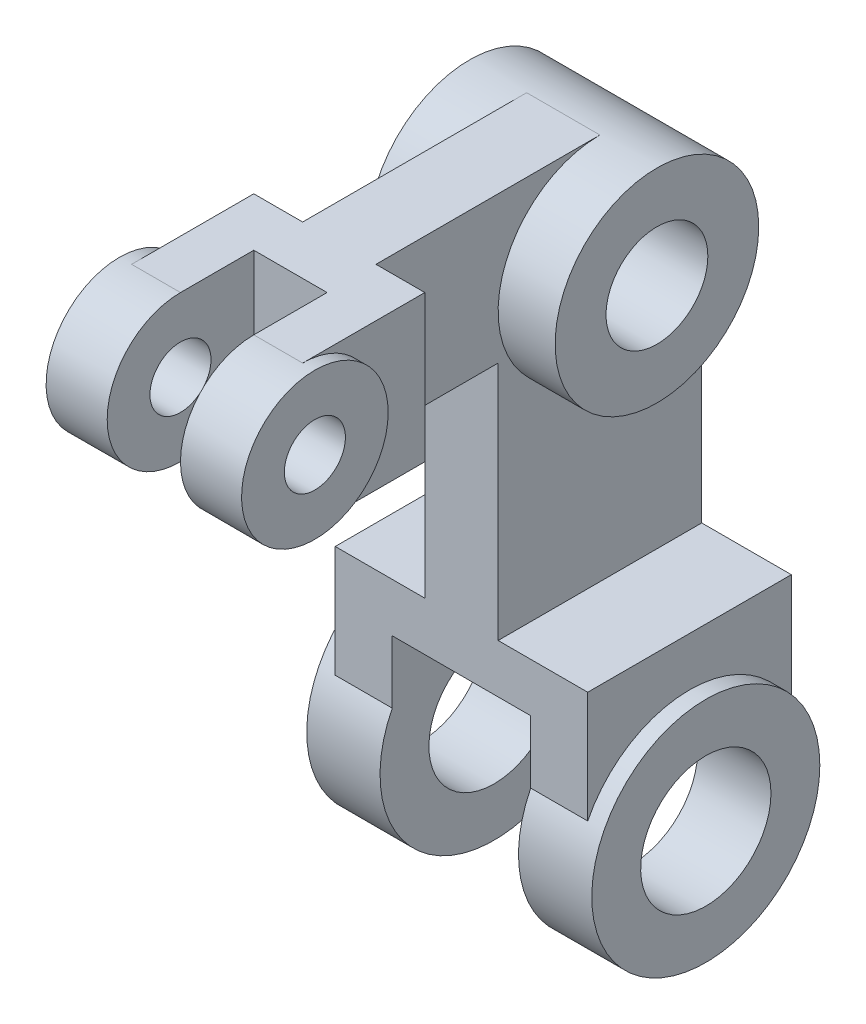
ISO-10303-21;
HEADER;
FILE_DESCRIPTION(('STEP AP214'),'2;1');
FILE_NAME('part.step','',(''),(''),'','','');
FILE_SCHEMA(('AUTOMOTIVE_DESIGN { 1 0 10303 214 1 1 1 1 }'));
ENDSEC;
DATA;
#1=APPLICATION_CONTEXT('core data for automotive mechanical design processes');
#2=APPLICATION_PROTOCOL_DEFINITION('international standard','automotive_design',2000,#1);
#3=PRODUCT_CONTEXT('',#1,'mechanical');
#4=PRODUCT('Part','Part','',(#3));
#5=PRODUCT_RELATED_PRODUCT_CATEGORY('part','',(#4));
#6=PRODUCT_DEFINITION_FORMATION('','',#4);
#7=PRODUCT_DEFINITION_CONTEXT('part definition',#1,'design');
#8=PRODUCT_DEFINITION('design','',#6,#7);
#9=PRODUCT_DEFINITION_SHAPE('','',#8);
#10=(LENGTH_UNIT() NAMED_UNIT(*) SI_UNIT(.MILLI.,.METRE.));
#11=(NAMED_UNIT(*) PLANE_ANGLE_UNIT() SI_UNIT($,.RADIAN.));
#12=(NAMED_UNIT(*) SI_UNIT($,.STERADIAN.) SOLID_ANGLE_UNIT());
#13=UNCERTAINTY_MEASURE_WITH_UNIT(LENGTH_MEASURE(1.E-05),#10,'distance_accuracy_value','');
#14=(GEOMETRIC_REPRESENTATION_CONTEXT(3) GLOBAL_UNCERTAINTY_ASSIGNED_CONTEXT((#13)) GLOBAL_UNIT_ASSIGNED_CONTEXT((#10,
#11,#12)) REPRESENTATION_CONTEXT('',''));
#15=CARTESIAN_POINT('',(0.,0.,0.));
#16=DIRECTION('',(0.,0.,1.));
#17=DIRECTION('',(1.,0.,0.));
#18=AXIS2_PLACEMENT_3D('',#15,#16,#17);
#19=CARTESIAN_POINT('',(24.,117.,85.));
#20=DIRECTION('',(-1.,0.,0.));
#21=DIRECTION('',(0.,0.,1.));
#22=AXIS2_PLACEMENT_3D('',#19,#20,#21);
#23=CYLINDRICAL_SURFACE('',#22,7.50000000000001);
#24=CARTESIAN_POINT('',(-8.99999999999999,117.,85.));
#25=DIRECTION('',(-1.,0.,0.));
#26=DIRECTION('',(0.,0.,1.));
#27=AXIS2_PLACEMENT_3D('',#24,#25,#26);
#28=CIRCLE('',#27,7.50000000000001);
#29=CARTESIAN_POINT('',(-8.99999999999999,117.,92.5));
#30=VERTEX_POINT('',#29);
#31=EDGE_CURVE('E226',#30,#30,#28,.T.);
#32=ORIENTED_EDGE('',*,*,#31,.F.);
#33=EDGE_LOOP('',(#32));
#34=FACE_BOUND('',#33,.T.);
#35=CARTESIAN_POINT('',(-24.,117.,85.));
#36=DIRECTION('',(1.,0.,0.));
#37=DIRECTION('',(0.,0.,-1.));
#38=AXIS2_PLACEMENT_3D('',#35,#36,#37);
#39=CIRCLE('',#38,7.50000000000001);
#40=CARTESIAN_POINT('',(-24.,117.,77.5));
#41=VERTEX_POINT('',#40);
#42=EDGE_CURVE('E253',#41,#41,#39,.T.);
#43=ORIENTED_EDGE('',*,*,#42,.F.);
#44=EDGE_LOOP('',(#43));
#45=FACE_BOUND('',#44,.T.);
#46=ADVANCED_FACE('F39',(#34,#45),#23,.F.);
#47=CARTESIAN_POINT('',(24.,117.,85.));
#48=DIRECTION('',(-1.,0.,0.));
#49=DIRECTION('',(0.,0.,1.));
#50=AXIS2_PLACEMENT_3D('',#47,#48,#49);
#51=CYLINDRICAL_SURFACE('',#50,18.);
#52=CARTESIAN_POINT('',(-24.,117.,85.));
#53=DIRECTION('',(1.,0.,0.));
#54=DIRECTION('',(0.,0.,-1.));
#55=AXIS2_PLACEMENT_3D('',#52,#53,#54);
#56=CIRCLE('',#55,18.);
#57=CARTESIAN_POINT('',(-24.,117.,67.));
#58=VERTEX_POINT('',#57);
#59=EDGE_CURVE('E258',#58,#58,#56,.T.);
#60=ORIENTED_EDGE('',*,*,#59,.T.);
#61=EDGE_LOOP('',(#60));
#62=FACE_BOUND('',#61,.T.);
#63=CARTESIAN_POINT('',(-8.99999999999999,117.,85.));
#64=DIRECTION('',(-1.,0.,0.));
#65=DIRECTION('',(0.,0.,1.));
#66=AXIS2_PLACEMENT_3D('',#63,#64,#65);
#67=CIRCLE('',#66,18.);
#68=CARTESIAN_POINT('',(-8.99999999999999,99.,85.));
#69=VERTEX_POINT('',#68);
#70=CARTESIAN_POINT('',(-8.99999999999999,135.,85.));
#71=VERTEX_POINT('',#70);
#72=EDGE_CURVE('E47',#69,#71,#67,.T.);
#73=ORIENTED_EDGE('',*,*,#72,.T.);
#74=DIRECTION('',(-1.,0.,0.));
#75=VECTOR('',#74,1.);
#76=CARTESIAN_POINT('',(21.,135.,85.));
#77=LINE('',#76,#75);
#78=CARTESIAN_POINT('',(-21.,135.,85.));
#79=VERTEX_POINT('',#78);
#80=EDGE_CURVE('E277',#71,#79,#77,.T.);
#81=ORIENTED_EDGE('',*,*,#80,.T.);
#82=CARTESIAN_POINT('',(-21.,117.,85.));
#83=DIRECTION('',(1.,0.,0.));
#84=DIRECTION('',(0.,0.,-1.));
#85=AXIS2_PLACEMENT_3D('',#82,#83,#84);
#86=CIRCLE('',#85,18.);
#87=CARTESIAN_POINT('',(-21.,99.,85.));
#88=VERTEX_POINT('',#87);
#89=EDGE_CURVE('E261',#88,#79,#86,.T.);
#90=ORIENTED_EDGE('',*,*,#89,.F.);
#91=DIRECTION('',(-1.,0.,0.));
#92=VECTOR('',#91,1.);
#93=CARTESIAN_POINT('',(21.,99.,85.));
#94=LINE('',#93,#92);
#95=EDGE_CURVE('E297',#69,#88,#94,.T.);
#96=ORIENTED_EDGE('',*,*,#95,.F.);
#97=EDGE_LOOP('',(#73,#81,#90,#96));
#98=FACE_BOUND('',#97,.T.);
#99=ADVANCED_FACE('F416',(#62,#98),#51,.T.);
#100=CARTESIAN_POINT('',(35.,0.,0.));
#101=DIRECTION('',(-1.,0.,0.));
#102=DIRECTION('',(0.,0.,1.));
#103=AXIS2_PLACEMENT_3D('',#100,#101,#102);
#104=CYLINDRICAL_SURFACE('',#103,16.);
#105=CARTESIAN_POINT('',(-17.,0.,0.));
#106=DIRECTION('',(-1.,0.,0.));
#107=DIRECTION('',(0.,-1.,0.));
#108=AXIS2_PLACEMENT_3D('',#105,#106,#107);
#109=CIRCLE('',#108,16.);
#110=CARTESIAN_POINT('',(-17.,-16.,0.));
#111=VERTEX_POINT('',#110);
#112=EDGE_CURVE('E247',#111,#111,#109,.T.);
#113=ORIENTED_EDGE('',*,*,#112,.F.);
#114=EDGE_LOOP('',(#113));
#115=FACE_BOUND('',#114,.T.);
#116=CARTESIAN_POINT('',(-35.,0.,0.));
#117=DIRECTION('',(1.,0.,0.));
#118=DIRECTION('',(0.,0.,-1.));
#119=AXIS2_PLACEMENT_3D('',#116,#117,#118);
#120=CIRCLE('',#119,16.);
#121=CARTESIAN_POINT('',(-35.,0.,-16.));
#122=VERTEX_POINT('',#121);
#123=EDGE_CURVE('E301',#122,#122,#120,.T.);
#124=ORIENTED_EDGE('',*,*,#123,.F.);
#125=EDGE_LOOP('',(#124));
#126=FACE_BOUND('',#125,.T.);
#127=ADVANCED_FACE('F482',(#115,#126),#104,.F.);
#128=CARTESIAN_POINT('',(35.,0.,0.));
#129=DIRECTION('',(-1.,0.,0.));
#130=DIRECTION('',(0.,0.,1.));
#131=AXIS2_PLACEMENT_3D('',#128,#129,#130);
#132=CYLINDRICAL_SURFACE('',#131,28.);
#133=CARTESIAN_POINT('',(35.,0.,0.));
#134=DIRECTION('',(1.,0.,0.));
#135=DIRECTION('',(0.,0.,-1.));
#136=AXIS2_PLACEMENT_3D('',#133,#134,#135);
#137=CIRCLE('',#136,28.);
#138=CARTESIAN_POINT('',(35.,0.,-28.));
#139=VERTEX_POINT('',#138);
#140=EDGE_CURVE('E305',#139,#139,#137,.T.);
#141=ORIENTED_EDGE('',*,*,#140,.F.);
#142=EDGE_LOOP('',(#141));
#143=FACE_BOUND('',#142,.T.);
#144=DIRECTION('',(-1.,0.,0.));
#145=VECTOR('',#144,1.);
#146=CARTESIAN_POINT('',(31.,12.6095202129185,25.));
#147=LINE('',#146,#145);
#148=CARTESIAN_POINT('',(31.,12.6095202129185,25.));
#149=VERTEX_POINT('',#148);
#150=CARTESIAN_POINT('',(17.,12.6095202129185,25.));
#151=VERTEX_POINT('',#150);
#152=EDGE_CURVE('E344',#149,#151,#147,.T.);
#153=ORIENTED_EDGE('',*,*,#152,.T.);
#154=CARTESIAN_POINT('',(17.,0.,0.));
#155=DIRECTION('',(1.,0.,0.));
#156=DIRECTION('',(0.,1.,0.));
#157=AXIS2_PLACEMENT_3D('',#154,#155,#156);
#158=CIRCLE('',#157,28.);
#159=CARTESIAN_POINT('',(17.,12.6095202129185,-25.));
#160=VERTEX_POINT('',#159);
#161=EDGE_CURVE('E408',#151,#160,#158,.T.);
#162=ORIENTED_EDGE('',*,*,#161,.T.);
#163=DIRECTION('',(-1.,0.,0.));
#164=VECTOR('',#163,1.);
#165=CARTESIAN_POINT('',(31.,12.6095202129185,-25.));
#166=LINE('',#165,#164);
#167=CARTESIAN_POINT('',(31.,12.6095202129185,-25.));
#168=VERTEX_POINT('',#167);
#169=EDGE_CURVE('E340',#168,#160,#166,.T.);
#170=ORIENTED_EDGE('',*,*,#169,.F.);
#171=CARTESIAN_POINT('',(31.,0.,0.));
#172=DIRECTION('',(1.,0.,0.));
#173=DIRECTION('',(0.,0.,-1.));
#174=AXIS2_PLACEMENT_3D('',#171,#172,#173);
#175=CIRCLE('',#174,28.);
#176=EDGE_CURVE('E321',#168,#149,#175,.T.);
#177=ORIENTED_EDGE('',*,*,#176,.T.);
#178=EDGE_LOOP('',(#153,#162,#170,#177));
#179=FACE_BOUND('',#178,.T.);
#180=ADVANCED_FACE('F580',(#143,#179),#132,.T.);
#181=CARTESIAN_POINT('',(9.,135.,0.));
#182=DIRECTION('',(0.,1.,0.));
#183=DIRECTION('',(0.,0.,1.));
#184=AXIS2_PLACEMENT_3D('',#181,#182,#183);
#185=PLANE('',#184);
#186=DIRECTION('',(0.,0.,1.));
#187=VECTOR('',#186,1.);
#188=CARTESIAN_POINT('',(-8.99999999999999,135.,67.));
#189=LINE('',#188,#187);
#190=CARTESIAN_POINT('',(-8.99999999999999,135.,67.));
#191=VERTEX_POINT('',#190);
#192=EDGE_CURVE('E211',#191,#71,#189,.T.);
#193=ORIENTED_EDGE('',*,*,#192,.F.);
#194=DIRECTION('',(-1.,0.,0.));
#195=VECTOR('',#194,1.);
#196=CARTESIAN_POINT('',(-8.99999999999999,135.,67.));
#197=LINE('',#196,#195);
#198=CARTESIAN_POINT('',(9.00000000000001,135.,67.));
#199=VERTEX_POINT('',#198);
#200=EDGE_CURVE('E200',#199,#191,#197,.T.);
#201=ORIENTED_EDGE('',*,*,#200,.F.);
#202=DIRECTION('',(0.,0.,-1.));
#203=VECTOR('',#202,1.);
#204=CARTESIAN_POINT('',(9.00000000000001,135.,67.));
#205=LINE('',#204,#203);
#206=CARTESIAN_POINT('',(9.00000000000001,135.,85.));
#207=VERTEX_POINT('',#206);
#208=EDGE_CURVE('E205',#207,#199,#205,.T.);
#209=ORIENTED_EDGE('',*,*,#208,.F.);
#210=CARTESIAN_POINT('',(21.,135.,85.));
#211=VERTEX_POINT('',#210);
#212=EDGE_CURVE('E288',#211,#207,#77,.T.);
#213=ORIENTED_EDGE('',*,*,#212,.F.);
#214=DIRECTION('',(0.,0.,-1.));
#215=VECTOR('',#214,1.);
#216=CARTESIAN_POINT('',(21.,135.,0.));
#217=LINE('',#216,#215);
#218=CARTESIAN_POINT('',(21.,135.,55.));
#219=VERTEX_POINT('',#218);
#220=EDGE_CURVE('E274',#211,#219,#217,.T.);
#221=ORIENTED_EDGE('',*,*,#220,.T.);
#222=DIRECTION('',(-1.,0.,0.));
#223=VECTOR('',#222,1.);
#224=CARTESIAN_POINT('',(21.,135.,55.));
#225=LINE('',#224,#223);
#226=CARTESIAN_POINT('',(9.,135.,55.));
#227=VERTEX_POINT('',#226);
#228=EDGE_CURVE('E291',#219,#227,#225,.T.);
#229=ORIENTED_EDGE('',*,*,#228,.T.);
#230=DIRECTION('',(0.,0.,-1.));
#231=VECTOR('',#230,1.);
#232=CARTESIAN_POINT('',(9.,135.,0.));
#233=LINE('',#232,#231);
#234=CARTESIAN_POINT('',(9.,135.,0.));
#235=VERTEX_POINT('',#234);
#236=EDGE_CURVE('E366',#227,#235,#233,.T.);
#237=ORIENTED_EDGE('',*,*,#236,.T.);
#238=DIRECTION('',(-1.,0.,0.));
#239=VECTOR('',#238,1.);
#240=CARTESIAN_POINT('',(9.,135.,0.));
#241=LINE('',#240,#239);
#242=CARTESIAN_POINT('',(-9.,135.,0.));
#243=VERTEX_POINT('',#242);
#244=EDGE_CURVE('E405',#235,#243,#241,.T.);
#245=ORIENTED_EDGE('',*,*,#244,.T.);
#246=DIRECTION('',(0.,0.,-1.));
#247=VECTOR('',#246,1.);
#248=CARTESIAN_POINT('',(-9.,135.,0.));
#249=LINE('',#248,#247);
#250=CARTESIAN_POINT('',(-8.99999999999999,135.,55.));
#251=VERTEX_POINT('',#250);
#252=EDGE_CURVE('E387',#251,#243,#249,.T.);
#253=ORIENTED_EDGE('',*,*,#252,.F.);
#254=CARTESIAN_POINT('',(-21.,135.,55.));
#255=VERTEX_POINT('',#254);
#256=EDGE_CURVE('E290',#251,#255,#225,.T.);
#257=ORIENTED_EDGE('',*,*,#256,.T.);
#258=DIRECTION('',(0.,0.,-1.));
#259=VECTOR('',#258,1.);
#260=CARTESIAN_POINT('',(-21.,135.,0.));
#261=LINE('',#260,#259);
#262=EDGE_CURVE('E269',#79,#255,#261,.T.);
#263=ORIENTED_EDGE('',*,*,#262,.F.);
#264=ORIENTED_EDGE('',*,*,#80,.F.);
#265=EDGE_LOOP('',(#193,#201,#209,#213,#221,#229,#237,#245,#253,#257,#263,#264));
#266=FACE_BOUND('',#265,.T.);
#267=ADVANCED_FACE('F41',(#266),#185,.T.);
#268=CARTESIAN_POINT('',(9.,99.,0.));
#269=DIRECTION('',(0.,1.,0.));
#270=DIRECTION('',(0.,0.,1.));
#271=AXIS2_PLACEMENT_3D('',#268,#269,#270);
#272=PLANE('',#271);
#273=DIRECTION('',(-1.,0.,0.));
#274=VECTOR('',#273,1.);
#275=CARTESIAN_POINT('',(9.,99.,67.));
#276=LINE('',#275,#274);
#277=CARTESIAN_POINT('',(9.00000000000001,99.,67.));
#278=VERTEX_POINT('',#277);
#279=CARTESIAN_POINT('',(-8.99999999999999,99.,67.));
#280=VERTEX_POINT('',#279);
#281=EDGE_CURVE('E11',#278,#280,#276,.T.);
#282=ORIENTED_EDGE('',*,*,#281,.T.);
#283=DIRECTION('',(0.,0.,1.));
#284=VECTOR('',#283,1.);
#285=CARTESIAN_POINT('',(-9.,99.,0.));
#286=LINE('',#285,#284);
#287=EDGE_CURVE('E223',#280,#69,#286,.T.);
#288=ORIENTED_EDGE('',*,*,#287,.T.);
#289=ORIENTED_EDGE('',*,*,#95,.T.);
#290=DIRECTION('',(0.,0.,-1.));
#291=VECTOR('',#290,1.);
#292=CARTESIAN_POINT('',(-21.,99.,0.));
#293=LINE('',#292,#291);
#294=CARTESIAN_POINT('',(-21.,99.,55.));
#295=VERTEX_POINT('',#294);
#296=EDGE_CURVE('E280',#88,#295,#293,.T.);
#297=ORIENTED_EDGE('',*,*,#296,.T.);
#298=DIRECTION('',(-1.,0.,0.));
#299=VECTOR('',#298,1.);
#300=CARTESIAN_POINT('',(21.,99.,55.));
#301=LINE('',#300,#299);
#302=CARTESIAN_POINT('',(-8.99999999999999,99.,55.));
#303=VERTEX_POINT('',#302);
#304=EDGE_CURVE('E294',#303,#295,#301,.T.);
#305=ORIENTED_EDGE('',*,*,#304,.F.);
#306=DIRECTION('',(0.,0.,-1.));
#307=VECTOR('',#306,1.);
#308=CARTESIAN_POINT('',(-9.,99.,0.));
#309=LINE('',#308,#307);
#310=CARTESIAN_POINT('',(-9.,99.,25.));
#311=VERTEX_POINT('',#310);
#312=EDGE_CURVE('E392',#303,#311,#309,.T.);
#313=ORIENTED_EDGE('',*,*,#312,.T.);
#314=DIRECTION('',(-1.,0.,0.));
#315=VECTOR('',#314,1.);
#316=CARTESIAN_POINT('',(9.,99.,25.));
#317=LINE('',#316,#315);
#318=CARTESIAN_POINT('',(9.,99.,25.));
#319=VERTEX_POINT('',#318);
#320=EDGE_CURVE('E402',#319,#311,#317,.T.);
#321=ORIENTED_EDGE('',*,*,#320,.F.);
#322=DIRECTION('',(0.,0.,-1.));
#323=VECTOR('',#322,1.);
#324=CARTESIAN_POINT('',(9.,99.,0.));
#325=LINE('',#324,#323);
#326=CARTESIAN_POINT('',(9.,99.,55.));
#327=VERTEX_POINT('',#326);
#328=EDGE_CURVE('E373',#327,#319,#325,.T.);
#329=ORIENTED_EDGE('',*,*,#328,.F.);
#330=CARTESIAN_POINT('',(21.,99.,55.));
#331=VERTEX_POINT('',#330);
#332=EDGE_CURVE('E295',#331,#327,#301,.T.);
#333=ORIENTED_EDGE('',*,*,#332,.F.);
#334=DIRECTION('',(0.,0.,-1.));
#335=VECTOR('',#334,1.);
#336=CARTESIAN_POINT('',(21.,99.,0.));
#337=LINE('',#336,#335);
#338=CARTESIAN_POINT('',(21.,99.,85.));
#339=VERTEX_POINT('',#338);
#340=EDGE_CURVE('E268',#339,#331,#337,.T.);
#341=ORIENTED_EDGE('',*,*,#340,.F.);
#342=CARTESIAN_POINT('',(9.00000000000001,99.,85.));
#343=VERTEX_POINT('',#342);
#344=EDGE_CURVE('E298',#339,#343,#94,.T.);
#345=ORIENTED_EDGE('',*,*,#344,.T.);
#346=DIRECTION('',(0.,0.,-1.));
#347=VECTOR('',#346,1.);
#348=CARTESIAN_POINT('',(9.,99.,0.));
#349=LINE('',#348,#347);
#350=EDGE_CURVE('E54',#343,#278,#349,.T.);
#351=ORIENTED_EDGE('',*,*,#350,.T.);
#352=EDGE_LOOP('',(#282,#288,#289,#297,#305,#313,#321,#329,#333,#341,#345,#351));
#353=FACE_BOUND('',#352,.T.);
#354=ADVANCED_FACE('F428',(#353),#272,.F.);
#355=CARTESIAN_POINT('',(9.,0.,25.));
#356=DIRECTION('',(0.,0.,-1.));
#357=DIRECTION('',(0.,1.,0.));
#358=AXIS2_PLACEMENT_3D('',#355,#356,#357);
#359=PLANE('',#358);
#360=CARTESIAN_POINT('',(-17.,12.6095202129185,25.));
#361=VERTEX_POINT('',#360);
#362=CARTESIAN_POINT('',(-31.,12.6095202129185,25.));
#363=VERTEX_POINT('',#362);
#364=EDGE_CURVE('E343',#361,#363,#147,.T.);
#365=ORIENTED_EDGE('',*,*,#364,.F.);
#366=DIRECTION('',(0.,1.,0.));
#367=VECTOR('',#366,1.);
#368=CARTESIAN_POINT('',(-17.,0.,25.));
#369=LINE('',#368,#367);
#370=CARTESIAN_POINT('',(-17.,28.,25.));
#371=VERTEX_POINT('',#370);
#372=EDGE_CURVE('E244',#361,#371,#369,.T.);
#373=ORIENTED_EDGE('',*,*,#372,.T.);
#374=DIRECTION('',(1.,0.,0.));
#375=VECTOR('',#374,1.);
#376=CARTESIAN_POINT('',(9.,28.,25.));
#377=LINE('',#376,#375);
#378=CARTESIAN_POINT('',(17.,28.,25.));
#379=VERTEX_POINT('',#378);
#380=EDGE_CURVE('E250',#371,#379,#377,.T.);
#381=ORIENTED_EDGE('',*,*,#380,.T.);
#382=DIRECTION('',(0.,-1.,0.));
#383=VECTOR('',#382,1.);
#384=CARTESIAN_POINT('',(17.,0.,25.));
#385=LINE('',#384,#383);
#386=EDGE_CURVE('E236',#379,#151,#385,.T.);
#387=ORIENTED_EDGE('',*,*,#386,.T.);
#388=ORIENTED_EDGE('',*,*,#152,.F.);
#389=DIRECTION('',(0.,-1.,0.));
#390=VECTOR('',#389,1.);
#391=CARTESIAN_POINT('',(31.,0.,25.));
#392=LINE('',#391,#390);
#393=CARTESIAN_POINT('',(31.,40.,25.));
#394=VERTEX_POINT('',#393);
#395=EDGE_CURVE('E317',#394,#149,#392,.T.);
#396=ORIENTED_EDGE('',*,*,#395,.F.);
#397=DIRECTION('',(-1.,0.,0.));
#398=VECTOR('',#397,1.);
#399=CARTESIAN_POINT('',(31.,40.,25.));
#400=LINE('',#399,#398);
#401=CARTESIAN_POINT('',(9.,40.,25.));
#402=VERTEX_POINT('',#401);
#403=EDGE_CURVE('E348',#394,#402,#400,.T.);
#404=ORIENTED_EDGE('',*,*,#403,.T.);
#405=DIRECTION('',(0.,-1.,0.));
#406=VECTOR('',#405,1.);
#407=CARTESIAN_POINT('',(9.,0.,25.));
#408=LINE('',#407,#406);
#409=EDGE_CURVE('E375',#319,#402,#408,.T.);
#410=ORIENTED_EDGE('',*,*,#409,.F.);
#411=ORIENTED_EDGE('',*,*,#320,.T.);
#412=DIRECTION('',(0.,-1.,0.));
#413=VECTOR('',#412,1.);
#414=CARTESIAN_POINT('',(-9.,0.,25.));
#415=LINE('',#414,#413);
#416=CARTESIAN_POINT('',(-9.,40.,25.));
#417=VERTEX_POINT('',#416);
#418=EDGE_CURVE('E394',#311,#417,#415,.T.);
#419=ORIENTED_EDGE('',*,*,#418,.T.);
#420=CARTESIAN_POINT('',(-31.,40.,25.));
#421=VERTEX_POINT('',#420);
#422=EDGE_CURVE('E347',#417,#421,#400,.T.);
#423=ORIENTED_EDGE('',*,*,#422,.T.);
#424=DIRECTION('',(0.,-1.,0.));
#425=VECTOR('',#424,1.);
#426=CARTESIAN_POINT('',(-31.,0.,25.));
#427=LINE('',#426,#425);
#428=EDGE_CURVE('E329',#421,#363,#427,.T.);
#429=ORIENTED_EDGE('',*,*,#428,.T.);
#430=EDGE_LOOP('',(#365,#373,#381,#387,#388,#396,#404,#410,#411,#419,#423,#429));
#431=FACE_BOUND('',#430,.T.);
#432=ADVANCED_FACE('F638',(#431),#359,.F.);
#433=CARTESIAN_POINT('',(9.,0.,-25.));
#434=DIRECTION('',(0.,0.,-1.));
#435=DIRECTION('',(0.,1.,0.));
#436=AXIS2_PLACEMENT_3D('',#433,#434,#435);
#437=PLANE('',#436);
#438=DIRECTION('',(0.,1.,0.));
#439=VECTOR('',#438,1.);
#440=CARTESIAN_POINT('',(-17.,0.,-25.));
#441=LINE('',#440,#439);
#442=CARTESIAN_POINT('',(-17.,12.6095202129185,-25.));
#443=VERTEX_POINT('',#442);
#444=CARTESIAN_POINT('',(-17.,28.,-25.));
#445=VERTEX_POINT('',#444);
#446=EDGE_CURVE('E242',#443,#445,#441,.T.);
#447=ORIENTED_EDGE('',*,*,#446,.F.);
#448=CARTESIAN_POINT('',(-31.,12.6095202129185,-25.));
#449=VERTEX_POINT('',#448);
#450=EDGE_CURVE('E339',#443,#449,#166,.T.);
#451=ORIENTED_EDGE('',*,*,#450,.T.);
#452=DIRECTION('',(0.,-1.,0.));
#453=VECTOR('',#452,1.);
#454=CARTESIAN_POINT('',(-31.,0.,-25.));
#455=LINE('',#454,#453);
#456=CARTESIAN_POINT('',(-31.,40.,-25.));
#457=VERTEX_POINT('',#456);
#458=EDGE_CURVE('E318',#457,#449,#455,.T.);
#459=ORIENTED_EDGE('',*,*,#458,.F.);
#460=DIRECTION('',(-1.,0.,0.));
#461=VECTOR('',#460,1.);
#462=CARTESIAN_POINT('',(31.,40.,-25.));
#463=LINE('',#462,#461);
#464=CARTESIAN_POINT('',(-9.,40.,-25.));
#465=VERTEX_POINT('',#464);
#466=EDGE_CURVE('E326',#465,#457,#463,.T.);
#467=ORIENTED_EDGE('',*,*,#466,.F.);
#468=DIRECTION('',(0.,-1.,0.));
#469=VECTOR('',#468,1.);
#470=CARTESIAN_POINT('',(-9.,0.,-25.));
#471=LINE('',#470,#469);
#472=CARTESIAN_POINT('',(-9.,110.,-25.));
#473=VERTEX_POINT('',#472);
#474=EDGE_CURVE('E367',#473,#465,#471,.T.);
#475=ORIENTED_EDGE('',*,*,#474,.F.);
#476=DIRECTION('',(-1.,0.,0.));
#477=VECTOR('',#476,1.);
#478=CARTESIAN_POINT('',(9.,110.,-25.));
#479=LINE('',#478,#477);
#480=CARTESIAN_POINT('',(9.,110.,-25.));
#481=VERTEX_POINT('',#480);
#482=EDGE_CURVE('E384',#481,#473,#479,.T.);
#483=ORIENTED_EDGE('',*,*,#482,.F.);
#484=DIRECTION('',(0.,-1.,0.));
#485=VECTOR('',#484,1.);
#486=CARTESIAN_POINT('',(9.,0.,-25.));
#487=LINE('',#486,#485);
#488=CARTESIAN_POINT('',(9.,40.,-25.));
#489=VERTEX_POINT('',#488);
#490=EDGE_CURVE('E381',#481,#489,#487,.T.);
#491=ORIENTED_EDGE('',*,*,#490,.T.);
#492=CARTESIAN_POINT('',(31.,40.,-25.));
#493=VERTEX_POINT('',#492);
#494=EDGE_CURVE('E337',#493,#489,#463,.T.);
#495=ORIENTED_EDGE('',*,*,#494,.F.);
#496=DIRECTION('',(0.,-1.,0.));
#497=VECTOR('',#496,1.);
#498=CARTESIAN_POINT('',(31.,0.,-25.));
#499=LINE('',#498,#497);
#500=EDGE_CURVE('E323',#493,#168,#499,.T.);
#501=ORIENTED_EDGE('',*,*,#500,.T.);
#502=ORIENTED_EDGE('',*,*,#169,.T.);
#503=DIRECTION('',(0.,-1.,0.));
#504=VECTOR('',#503,1.);
#505=CARTESIAN_POINT('',(17.,0.,-25.));
#506=LINE('',#505,#504);
#507=CARTESIAN_POINT('',(17.,28.,-25.));
#508=VERTEX_POINT('',#507);
#509=EDGE_CURVE('E62',#508,#160,#506,.T.);
#510=ORIENTED_EDGE('',*,*,#509,.F.);
#511=DIRECTION('',(1.,0.,0.));
#512=VECTOR('',#511,1.);
#513=CARTESIAN_POINT('',(9.,28.,-25.));
#514=LINE('',#513,#512);
#515=EDGE_CURVE('E412',#445,#508,#514,.T.);
#516=ORIENTED_EDGE('',*,*,#515,.F.);
#517=EDGE_LOOP('',(#447,#451,#459,#467,#475,#483,#491,#495,#501,#502,#510,#516));
#518=FACE_BOUND('',#517,.T.);
#519=ADVANCED_FACE('F455',(#518),#437,.T.);
#520=CARTESIAN_POINT('',(9.,0.,0.));
#521=DIRECTION('',(1.,0.,0.));
#522=DIRECTION('',(0.,0.,-1.));
#523=AXIS2_PLACEMENT_3D('',#520,#521,#522);
#524=PLANE('',#523);
#525=CARTESIAN_POINT('',(9.,110.,0.));
#526=DIRECTION('',(1.,0.,0.));
#527=DIRECTION('',(0.,0.,-1.));
#528=AXIS2_PLACEMENT_3D('',#525,#526,#527);
#529=CIRCLE('',#528,25.);
#530=EDGE_CURVE('E364',#235,#481,#529,.T.);
#531=ORIENTED_EDGE('',*,*,#530,.F.);
#532=ORIENTED_EDGE('',*,*,#236,.F.);
#533=DIRECTION('',(0.,-1.,0.));
#534=VECTOR('',#533,1.);
#535=CARTESIAN_POINT('',(9.,0.,55.));
#536=LINE('',#535,#534);
#537=EDGE_CURVE('E370',#227,#327,#536,.T.);
#538=ORIENTED_EDGE('',*,*,#537,.T.);
#539=ORIENTED_EDGE('',*,*,#328,.T.);
#540=ORIENTED_EDGE('',*,*,#409,.T.);
#541=DIRECTION('',(0.,0.,-1.));
#542=VECTOR('',#541,1.);
#543=CARTESIAN_POINT('',(9.,40.,0.));
#544=LINE('',#543,#542);
#545=EDGE_CURVE('E378',#402,#489,#544,.T.);
#546=ORIENTED_EDGE('',*,*,#545,.T.);
#547=ORIENTED_EDGE('',*,*,#490,.F.);
#548=EDGE_LOOP('',(#531,#532,#538,#539,#540,#546,#547));
#549=FACE_BOUND('',#548,.T.);
#550=ADVANCED_FACE('F445',(#549),#524,.T.);
#551=CARTESIAN_POINT('',(-9.,0.,0.));
#552=DIRECTION('',(1.,0.,0.));
#553=DIRECTION('',(0.,0.,-1.));
#554=AXIS2_PLACEMENT_3D('',#551,#552,#553);
#555=PLANE('',#554);
#556=CARTESIAN_POINT('',(-9.,110.,0.));
#557=DIRECTION('',(1.,0.,0.));
#558=DIRECTION('',(0.,0.,-1.));
#559=AXIS2_PLACEMENT_3D('',#556,#557,#558);
#560=CIRCLE('',#559,25.);
#561=EDGE_CURVE('E359',#243,#473,#560,.T.);
#562=ORIENTED_EDGE('',*,*,#561,.T.);
#563=ORIENTED_EDGE('',*,*,#474,.T.);
#564=DIRECTION('',(0.,0.,-1.));
#565=VECTOR('',#564,1.);
#566=CARTESIAN_POINT('',(-9.,40.,0.));
#567=LINE('',#566,#565);
#568=EDGE_CURVE('E397',#417,#465,#567,.T.);
#569=ORIENTED_EDGE('',*,*,#568,.F.);
#570=ORIENTED_EDGE('',*,*,#418,.F.);
#571=ORIENTED_EDGE('',*,*,#312,.F.);
#572=DIRECTION('',(0.,-1.,0.));
#573=VECTOR('',#572,1.);
#574=CARTESIAN_POINT('',(-9.,0.,55.));
#575=LINE('',#574,#573);
#576=EDGE_CURVE('E390',#251,#303,#575,.T.);
#577=ORIENTED_EDGE('',*,*,#576,.F.);
#578=ORIENTED_EDGE('',*,*,#252,.T.);
#579=EDGE_LOOP('',(#562,#563,#569,#570,#571,#577,#578));
#580=FACE_BOUND('',#579,.T.);
#581=ADVANCED_FACE('F460',(#580),#555,.F.);
#582=CARTESIAN_POINT('',(23.,110.,0.));
#583=DIRECTION('',(-1.,0.,0.));
#584=DIRECTION('',(0.,0.,1.));
#585=AXIS2_PLACEMENT_3D('',#582,#583,#584);
#586=CYLINDRICAL_SURFACE('',#585,25.);
#587=ORIENTED_EDGE('',*,*,#530,.T.);
#588=ORIENTED_EDGE('',*,*,#482,.T.);
#589=ORIENTED_EDGE('',*,*,#561,.F.);
#590=ORIENTED_EDGE('',*,*,#244,.F.);
#591=EDGE_LOOP('',(#587,#588,#589,#590));
#592=FACE_BOUND('',#591,.T.);
#593=CARTESIAN_POINT('',(23.,110.,0.));
#594=DIRECTION('',(1.,0.,0.));
#595=DIRECTION('',(0.,0.,-1.));
#596=AXIS2_PLACEMENT_3D('',#593,#594,#595);
#597=CIRCLE('',#596,25.);
#598=CARTESIAN_POINT('',(23.,110.,-25.));
#599=VERTEX_POINT('',#598);
#600=EDGE_CURVE('E352',#599,#599,#597,.T.);
#601=ORIENTED_EDGE('',*,*,#600,.F.);
#602=EDGE_LOOP('',(#601));
#603=FACE_BOUND('',#602,.T.);
#604=CARTESIAN_POINT('',(-23.,110.,0.));
#605=DIRECTION('',(1.,0.,0.));
#606=DIRECTION('',(0.,0.,-1.));
#607=AXIS2_PLACEMENT_3D('',#604,#605,#606);
#608=CIRCLE('',#607,25.);
#609=CARTESIAN_POINT('',(-23.,110.,-25.));
#610=VERTEX_POINT('',#609);
#611=EDGE_CURVE('E351',#610,#610,#608,.T.);
#612=ORIENTED_EDGE('',*,*,#611,.T.);
#613=EDGE_LOOP('',(#612));
#614=FACE_BOUND('',#613,.T.);
#615=ADVANCED_FACE('F450',(#592,#603,#614),#586,.T.);
#616=CARTESIAN_POINT('',(23.,110.,0.));
#617=DIRECTION('',(-1.,0.,0.));
#618=DIRECTION('',(0.,0.,1.));
#619=AXIS2_PLACEMENT_3D('',#616,#617,#618);
#620=CYLINDRICAL_SURFACE('',#619,12.5);
#621=CARTESIAN_POINT('',(23.,110.,0.));
#622=DIRECTION('',(1.,0.,0.));
#623=DIRECTION('',(0.,0.,-1.));
#624=AXIS2_PLACEMENT_3D('',#621,#622,#623);
#625=CIRCLE('',#624,12.5);
#626=CARTESIAN_POINT('',(23.,110.,-12.5));
#627=VERTEX_POINT('',#626);
#628=EDGE_CURVE('E355',#627,#627,#625,.T.);
#629=ORIENTED_EDGE('',*,*,#628,.T.);
#630=EDGE_LOOP('',(#629));
#631=FACE_BOUND('',#630,.T.);
#632=CARTESIAN_POINT('',(-23.,110.,0.));
#633=DIRECTION('',(1.,0.,0.));
#634=DIRECTION('',(0.,0.,-1.));
#635=AXIS2_PLACEMENT_3D('',#632,#633,#634);
#636=CIRCLE('',#635,12.5);
#637=CARTESIAN_POINT('',(-23.,110.,-12.5));
#638=VERTEX_POINT('',#637);
#639=EDGE_CURVE('E356',#638,#638,#636,.T.);
#640=ORIENTED_EDGE('',*,*,#639,.F.);
#641=EDGE_LOOP('',(#640));
#642=FACE_BOUND('',#641,.T.);
#643=ADVANCED_FACE('F715',(#631,#642),#620,.F.);
#644=CARTESIAN_POINT('',(23.,0.,0.));
#645=DIRECTION('',(1.,0.,0.));
#646=DIRECTION('',(0.,0.,-1.));
#647=AXIS2_PLACEMENT_3D('',#644,#645,#646);
#648=PLANE('',#647);
#649=ORIENTED_EDGE('',*,*,#600,.T.);
#650=EDGE_LOOP('',(#649));
#651=FACE_BOUND('',#650,.T.);
#652=ORIENTED_EDGE('',*,*,#628,.F.);
#653=EDGE_LOOP('',(#652));
#654=FACE_BOUND('',#653,.T.);
#655=ADVANCED_FACE('F721',(#651,#654),#648,.T.);
#656=CARTESIAN_POINT('',(-23.,0.,0.));
#657=DIRECTION('',(1.,0.,0.));
#658=DIRECTION('',(0.,0.,-1.));
#659=AXIS2_PLACEMENT_3D('',#656,#657,#658);
#660=PLANE('',#659);
#661=ORIENTED_EDGE('',*,*,#611,.F.);
#662=EDGE_LOOP('',(#661));
#663=FACE_BOUND('',#662,.T.);
#664=ORIENTED_EDGE('',*,*,#639,.T.);
#665=EDGE_LOOP('',(#664));
#666=FACE_BOUND('',#665,.T.);
#667=ADVANCED_FACE('F729',(#663,#666),#660,.F.);
#668=CARTESIAN_POINT('',(31.,40.,0.));
#669=DIRECTION('',(0.,1.,0.));
#670=DIRECTION('',(0.,0.,1.));
#671=AXIS2_PLACEMENT_3D('',#668,#669,#670);
#672=PLANE('',#671);
#673=ORIENTED_EDGE('',*,*,#545,.F.);
#674=ORIENTED_EDGE('',*,*,#403,.F.);
#675=DIRECTION('',(0.,0.,-1.));
#676=VECTOR('',#675,1.);
#677=CARTESIAN_POINT('',(31.,40.,0.));
#678=LINE('',#677,#676);
#679=EDGE_CURVE('E314',#394,#493,#678,.T.);
#680=ORIENTED_EDGE('',*,*,#679,.T.);
#681=ORIENTED_EDGE('',*,*,#494,.T.);
#682=EDGE_LOOP('',(#673,#674,#680,#681));
#683=FACE_BOUND('',#682,.T.);
#684=ADVANCED_FACE('F737',(#683),#672,.T.);
#685=ORIENTED_EDGE('',*,*,#422,.F.);
#686=ORIENTED_EDGE('',*,*,#568,.T.);
#687=ORIENTED_EDGE('',*,*,#466,.T.);
#688=DIRECTION('',(0.,0.,-1.));
#689=VECTOR('',#688,1.);
#690=CARTESIAN_POINT('',(-31.,40.,0.));
#691=LINE('',#690,#689);
#692=EDGE_CURVE('E309',#421,#457,#691,.T.);
#693=ORIENTED_EDGE('',*,*,#692,.F.);
#694=EDGE_LOOP('',(#685,#686,#687,#693));
#695=FACE_BOUND('',#694,.T.);
#696=ADVANCED_FACE('F745',(#695),#672,.T.);
#697=CARTESIAN_POINT('',(31.,0.,0.));
#698=DIRECTION('',(1.,0.,0.));
#699=DIRECTION('',(0.,0.,-1.));
#700=AXIS2_PLACEMENT_3D('',#697,#698,#699);
#701=PLANE('',#700);
#702=ORIENTED_EDGE('',*,*,#679,.F.);
#703=ORIENTED_EDGE('',*,*,#395,.T.);
#704=ORIENTED_EDGE('',*,*,#176,.F.);
#705=ORIENTED_EDGE('',*,*,#500,.F.);
#706=EDGE_LOOP('',(#702,#703,#704,#705));
#707=FACE_BOUND('',#706,.T.);
#708=ADVANCED_FACE('F657',(#707),#701,.T.);
#709=CARTESIAN_POINT('',(-31.,0.,0.));
#710=DIRECTION('',(1.,0.,0.));
#711=DIRECTION('',(0.,0.,-1.));
#712=AXIS2_PLACEMENT_3D('',#709,#710,#711);
#713=PLANE('',#712);
#714=ORIENTED_EDGE('',*,*,#692,.T.);
#715=ORIENTED_EDGE('',*,*,#458,.T.);
#716=CARTESIAN_POINT('',(-31.,0.,0.));
#717=DIRECTION('',(1.,0.,0.));
#718=DIRECTION('',(0.,0.,-1.));
#719=AXIS2_PLACEMENT_3D('',#716,#717,#718);
#720=CIRCLE('',#719,28.);
#721=EDGE_CURVE('E332',#449,#363,#720,.T.);
#722=ORIENTED_EDGE('',*,*,#721,.T.);
#723=ORIENTED_EDGE('',*,*,#428,.F.);
#724=EDGE_LOOP('',(#714,#715,#722,#723));
#725=FACE_BOUND('',#724,.T.);
#726=ADVANCED_FACE('F651',(#725),#713,.F.);
#727=CARTESIAN_POINT('',(17.,0.,0.));
#728=DIRECTION('',(1.,0.,0.));
#729=DIRECTION('',(0.,1.,0.));
#730=AXIS2_PLACEMENT_3D('',#727,#728,#729);
#731=CIRCLE('',#730,16.);
#732=CARTESIAN_POINT('',(17.,16.,0.));
#733=VERTEX_POINT('',#732);
#734=EDGE_CURVE('E239',#733,#733,#731,.T.);
#735=ORIENTED_EDGE('',*,*,#734,.F.);
#736=EDGE_LOOP('',(#735));
#737=FACE_BOUND('',#736,.T.);
#738=CARTESIAN_POINT('',(35.,0.,0.));
#739=DIRECTION('',(1.,0.,0.));
#740=DIRECTION('',(0.,0.,-1.));
#741=AXIS2_PLACEMENT_3D('',#738,#739,#740);
#742=CIRCLE('',#741,16.);
#743=CARTESIAN_POINT('',(35.,0.,-16.));
#744=VERTEX_POINT('',#743);
#745=EDGE_CURVE('E302',#744,#744,#742,.T.);
#746=ORIENTED_EDGE('',*,*,#745,.T.);
#747=EDGE_LOOP('',(#746));
#748=FACE_BOUND('',#747,.T.);
#749=ADVANCED_FACE('F583',(#737,#748),#104,.F.);
#750=ORIENTED_EDGE('',*,*,#450,.F.);
#751=CARTESIAN_POINT('',(-17.,0.,0.));
#752=DIRECTION('',(-1.,0.,0.));
#753=DIRECTION('',(0.,-1.,0.));
#754=AXIS2_PLACEMENT_3D('',#751,#752,#753);
#755=CIRCLE('',#754,28.);
#756=EDGE_CURVE('E410',#443,#361,#755,.T.);
#757=ORIENTED_EDGE('',*,*,#756,.T.);
#758=ORIENTED_EDGE('',*,*,#364,.T.);
#759=ORIENTED_EDGE('',*,*,#721,.F.);
#760=EDGE_LOOP('',(#750,#757,#758,#759));
#761=FACE_BOUND('',#760,.T.);
#762=CARTESIAN_POINT('',(-35.,0.,0.));
#763=DIRECTION('',(1.,0.,0.));
#764=DIRECTION('',(0.,0.,-1.));
#765=AXIS2_PLACEMENT_3D('',#762,#763,#764);
#766=CIRCLE('',#765,28.);
#767=CARTESIAN_POINT('',(-35.,0.,-28.));
#768=VERTEX_POINT('',#767);
#769=EDGE_CURVE('E306',#768,#768,#766,.T.);
#770=ORIENTED_EDGE('',*,*,#769,.T.);
#771=EDGE_LOOP('',(#770));
#772=FACE_BOUND('',#771,.T.);
#773=ADVANCED_FACE('F593',(#761,#772),#132,.T.);
#774=CARTESIAN_POINT('',(35.,0.,0.));
#775=DIRECTION('',(1.,0.,0.));
#776=DIRECTION('',(0.,0.,-1.));
#777=AXIS2_PLACEMENT_3D('',#774,#775,#776);
#778=PLANE('',#777);
#779=ORIENTED_EDGE('',*,*,#745,.F.);
#780=EDGE_LOOP('',(#779));
#781=FACE_BOUND('',#780,.T.);
#782=ORIENTED_EDGE('',*,*,#140,.T.);
#783=EDGE_LOOP('',(#782));
#784=FACE_BOUND('',#783,.T.);
#785=ADVANCED_FACE('F671',(#781,#784),#778,.T.);
#786=CARTESIAN_POINT('',(-35.,0.,0.));
#787=DIRECTION('',(1.,0.,0.));
#788=DIRECTION('',(0.,0.,-1.));
#789=AXIS2_PLACEMENT_3D('',#786,#787,#788);
#790=PLANE('',#789);
#791=ORIENTED_EDGE('',*,*,#123,.T.);
#792=EDGE_LOOP('',(#791));
#793=FACE_BOUND('',#792,.T.);
#794=ORIENTED_EDGE('',*,*,#769,.F.);
#795=EDGE_LOOP('',(#794));
#796=FACE_BOUND('',#795,.T.);
#797=ADVANCED_FACE('F472',(#793,#796),#790,.F.);
#798=CARTESIAN_POINT('',(21.,0.,55.));
#799=DIRECTION('',(0.,0.,-1.));
#800=DIRECTION('',(0.,1.,0.));
#801=AXIS2_PLACEMENT_3D('',#798,#799,#800);
#802=PLANE('',#801);
#803=ORIENTED_EDGE('',*,*,#537,.F.);
#804=ORIENTED_EDGE('',*,*,#228,.F.);
#805=DIRECTION('',(0.,-1.,0.));
#806=VECTOR('',#805,1.);
#807=CARTESIAN_POINT('',(21.,0.,55.));
#808=LINE('',#807,#806);
#809=EDGE_CURVE('E271',#219,#331,#808,.T.);
#810=ORIENTED_EDGE('',*,*,#809,.T.);
#811=ORIENTED_EDGE('',*,*,#332,.T.);
#812=EDGE_LOOP('',(#803,#804,#810,#811));
#813=FACE_BOUND('',#812,.T.);
#814=ADVANCED_FACE('F441',(#813),#802,.T.);
#815=ORIENTED_EDGE('',*,*,#256,.F.);
#816=ORIENTED_EDGE('',*,*,#576,.T.);
#817=ORIENTED_EDGE('',*,*,#304,.T.);
#818=DIRECTION('',(0.,-1.,0.));
#819=VECTOR('',#818,1.);
#820=CARTESIAN_POINT('',(-21.,0.,55.));
#821=LINE('',#820,#819);
#822=EDGE_CURVE('E283',#255,#295,#821,.T.);
#823=ORIENTED_EDGE('',*,*,#822,.F.);
#824=EDGE_LOOP('',(#815,#816,#817,#823));
#825=FACE_BOUND('',#824,.T.);
#826=ADVANCED_FACE('F464',(#825),#802,.T.);
#827=CARTESIAN_POINT('',(21.,0.,0.));
#828=DIRECTION('',(1.,0.,0.));
#829=DIRECTION('',(0.,0.,-1.));
#830=AXIS2_PLACEMENT_3D('',#827,#828,#829);
#831=PLANE('',#830);
#832=CARTESIAN_POINT('',(21.,117.,85.));
#833=DIRECTION('',(1.,0.,0.));
#834=DIRECTION('',(0.,0.,-1.));
#835=AXIS2_PLACEMENT_3D('',#832,#833,#834);
#836=CIRCLE('',#835,18.);
#837=EDGE_CURVE('E266',#339,#211,#836,.T.);
#838=ORIENTED_EDGE('',*,*,#837,.F.);
#839=ORIENTED_EDGE('',*,*,#340,.T.);
#840=ORIENTED_EDGE('',*,*,#809,.F.);
#841=ORIENTED_EDGE('',*,*,#220,.F.);
#842=EDGE_LOOP('',(#838,#839,#840,#841));
#843=FACE_BOUND('',#842,.T.);
#844=ADVANCED_FACE('F439',(#843),#831,.T.);
#845=CARTESIAN_POINT('',(-21.,0.,0.));
#846=DIRECTION('',(1.,0.,0.));
#847=DIRECTION('',(0.,0.,-1.));
#848=AXIS2_PLACEMENT_3D('',#845,#846,#847);
#849=PLANE('',#848);
#850=ORIENTED_EDGE('',*,*,#89,.T.);
#851=ORIENTED_EDGE('',*,*,#262,.T.);
#852=ORIENTED_EDGE('',*,*,#822,.T.);
#853=ORIENTED_EDGE('',*,*,#296,.F.);
#854=EDGE_LOOP('',(#850,#851,#852,#853));
#855=FACE_BOUND('',#854,.T.);
#856=ADVANCED_FACE('F424',(#855),#849,.F.);
#857=CARTESIAN_POINT('',(9.00000000000001,117.,85.));
#858=DIRECTION('',(1.,0.,0.));
#859=DIRECTION('',(0.,0.,-1.));
#860=AXIS2_PLACEMENT_3D('',#857,#858,#859);
#861=CIRCLE('',#860,7.50000000000001);
#862=CARTESIAN_POINT('',(9.00000000000001,117.,77.5));
#863=VERTEX_POINT('',#862);
#864=EDGE_CURVE('E220',#863,#863,#861,.T.);
#865=ORIENTED_EDGE('',*,*,#864,.F.);
#866=EDGE_LOOP('',(#865));
#867=FACE_BOUND('',#866,.T.);
#868=CARTESIAN_POINT('',(24.,117.,85.));
#869=DIRECTION('',(1.,0.,0.));
#870=DIRECTION('',(0.,0.,-1.));
#871=AXIS2_PLACEMENT_3D('',#868,#869,#870);
#872=CIRCLE('',#871,7.50000000000001);
#873=CARTESIAN_POINT('',(24.,117.,77.5));
#874=VERTEX_POINT('',#873);
#875=EDGE_CURVE('E254',#874,#874,#872,.T.);
#876=ORIENTED_EDGE('',*,*,#875,.T.);
#877=EDGE_LOOP('',(#876));
#878=FACE_BOUND('',#877,.T.);
#879=ADVANCED_FACE('F478',(#867,#878),#23,.F.);
#880=ORIENTED_EDGE('',*,*,#212,.T.);
#881=CARTESIAN_POINT('',(9.00000000000001,117.,85.));
#882=DIRECTION('',(1.,0.,0.));
#883=DIRECTION('',(0.,0.,-1.));
#884=AXIS2_PLACEMENT_3D('',#881,#882,#883);
#885=CIRCLE('',#884,18.);
#886=EDGE_CURVE('E207',#207,#343,#885,.T.);
#887=ORIENTED_EDGE('',*,*,#886,.T.);
#888=ORIENTED_EDGE('',*,*,#344,.F.);
#889=ORIENTED_EDGE('',*,*,#837,.T.);
#890=EDGE_LOOP('',(#880,#887,#888,#889));
#891=FACE_BOUND('',#890,.T.);
#892=CARTESIAN_POINT('',(24.,117.,85.));
#893=DIRECTION('',(1.,0.,0.));
#894=DIRECTION('',(0.,0.,-1.));
#895=AXIS2_PLACEMENT_3D('',#892,#893,#894);
#896=CIRCLE('',#895,18.);
#897=CARTESIAN_POINT('',(24.,117.,67.));
#898=VERTEX_POINT('',#897);
#899=EDGE_CURVE('E257',#898,#898,#896,.T.);
#900=ORIENTED_EDGE('',*,*,#899,.F.);
#901=EDGE_LOOP('',(#900));
#902=FACE_BOUND('',#901,.T.);
#903=ADVANCED_FACE('F434',(#891,#902),#51,.T.);
#904=CARTESIAN_POINT('',(24.,0.,0.));
#905=DIRECTION('',(1.,0.,0.));
#906=DIRECTION('',(0.,0.,-1.));
#907=AXIS2_PLACEMENT_3D('',#904,#905,#906);
#908=PLANE('',#907);
#909=ORIENTED_EDGE('',*,*,#875,.F.);
#910=EDGE_LOOP('',(#909));
#911=FACE_BOUND('',#910,.T.);
#912=ORIENTED_EDGE('',*,*,#899,.T.);
#913=EDGE_LOOP('',(#912));
#914=FACE_BOUND('',#913,.T.);
#915=ADVANCED_FACE('F493',(#911,#914),#908,.T.);
#916=CARTESIAN_POINT('',(-24.,0.,0.));
#917=DIRECTION('',(1.,0.,0.));
#918=DIRECTION('',(0.,0.,-1.));
#919=AXIS2_PLACEMENT_3D('',#916,#917,#918);
#920=PLANE('',#919);
#921=ORIENTED_EDGE('',*,*,#42,.T.);
#922=EDGE_LOOP('',(#921));
#923=FACE_BOUND('',#922,.T.);
#924=ORIENTED_EDGE('',*,*,#59,.F.);
#925=EDGE_LOOP('',(#924));
#926=FACE_BOUND('',#925,.T.);
#927=ADVANCED_FACE('F500',(#923,#926),#920,.F.);
#928=CARTESIAN_POINT('',(-17.,28.,-28.));
#929=DIRECTION('',(0.,1.,0.));
#930=DIRECTION('',(0.,0.,1.));
#931=AXIS2_PLACEMENT_3D('',#928,#929,#930);
#932=PLANE('',#931);
#933=DIRECTION('',(0.,0.,1.));
#934=VECTOR('',#933,1.);
#935=CARTESIAN_POINT('',(-17.,28.,-28.));
#936=LINE('',#935,#934);
#937=EDGE_CURVE('E230',#445,#371,#936,.T.);
#938=ORIENTED_EDGE('',*,*,#937,.F.);
#939=ORIENTED_EDGE('',*,*,#515,.T.);
#940=DIRECTION('',(0.,0.,1.));
#941=VECTOR('',#940,1.);
#942=CARTESIAN_POINT('',(17.,28.,-28.));
#943=LINE('',#942,#941);
#944=EDGE_CURVE('E229',#508,#379,#943,.T.);
#945=ORIENTED_EDGE('',*,*,#944,.T.);
#946=ORIENTED_EDGE('',*,*,#380,.F.);
#947=EDGE_LOOP('',(#938,#939,#945,#946));
#948=FACE_BOUND('',#947,.T.);
#949=ADVANCED_FACE('F506',(#948),#932,.F.);
#950=CARTESIAN_POINT('',(-17.,28.,-28.));
#951=DIRECTION('',(-1.,0.,0.));
#952=DIRECTION('',(0.,-1.,0.));
#953=AXIS2_PLACEMENT_3D('',#950,#951,#952);
#954=PLANE('',#953);
#955=ORIENTED_EDGE('',*,*,#112,.T.);
#956=EDGE_LOOP('',(#955));
#957=FACE_BOUND('',#956,.T.);
#958=ORIENTED_EDGE('',*,*,#372,.F.);
#959=ORIENTED_EDGE('',*,*,#756,.F.);
#960=ORIENTED_EDGE('',*,*,#446,.T.);
#961=ORIENTED_EDGE('',*,*,#937,.T.);
#962=EDGE_LOOP('',(#958,#959,#960,#961));
#963=FACE_BOUND('',#962,.T.);
#964=ADVANCED_FACE('F510',(#957,#963),#954,.F.);
#965=CARTESIAN_POINT('',(17.,28.,-28.));
#966=DIRECTION('',(1.,0.,0.));
#967=DIRECTION('',(0.,1.,0.));
#968=AXIS2_PLACEMENT_3D('',#965,#966,#967);
#969=PLANE('',#968);
#970=ORIENTED_EDGE('',*,*,#734,.T.);
#971=EDGE_LOOP('',(#970));
#972=FACE_BOUND('',#971,.T.);
#973=ORIENTED_EDGE('',*,*,#944,.F.);
#974=ORIENTED_EDGE('',*,*,#509,.T.);
#975=ORIENTED_EDGE('',*,*,#161,.F.);
#976=ORIENTED_EDGE('',*,*,#386,.F.);
#977=EDGE_LOOP('',(#973,#974,#975,#976));
#978=FACE_BOUND('',#977,.T.);
#979=ADVANCED_FACE('F513',(#972,#978),#969,.F.);
#980=CARTESIAN_POINT('',(-8.99999999999999,-28.,66.9999999999999));
#981=DIRECTION('',(0.,0.,-1.));
#982=DIRECTION('',(0.,1.,0.));
#983=AXIS2_PLACEMENT_3D('',#980,#981,#982);
#984=PLANE('',#983);
#985=DIRECTION('',(0.,1.,0.));
#986=VECTOR('',#985,1.);
#987=CARTESIAN_POINT('',(9.00000000000001,-28.,66.9999999999999));
#988=LINE('',#987,#986);
#989=EDGE_CURVE('E195',#278,#199,#988,.T.);
#990=ORIENTED_EDGE('',*,*,#989,.T.);
#991=ORIENTED_EDGE('',*,*,#200,.T.);
#992=DIRECTION('',(0.,1.,0.));
#993=VECTOR('',#992,1.);
#994=CARTESIAN_POINT('',(-8.99999999999999,-28.,66.9999999999999));
#995=LINE('',#994,#993);
#996=EDGE_CURVE('E202',#280,#191,#995,.T.);
#997=ORIENTED_EDGE('',*,*,#996,.F.);
#998=ORIENTED_EDGE('',*,*,#281,.F.);
#999=EDGE_LOOP('',(#990,#991,#997,#998));
#1000=FACE_BOUND('',#999,.T.);
#1001=ADVANCED_FACE('F197',(#1000),#984,.F.);
#1002=CARTESIAN_POINT('',(-8.99999999999999,-28.,66.9999999999999));
#1003=DIRECTION('',(-1.,0.,0.));
#1004=DIRECTION('',(0.,0.,1.));
#1005=AXIS2_PLACEMENT_3D('',#1002,#1003,#1004);
#1006=PLANE('',#1005);
#1007=ORIENTED_EDGE('',*,*,#31,.T.);
#1008=EDGE_LOOP('',(#1007));
#1009=FACE_BOUND('',#1008,.T.);
#1010=ORIENTED_EDGE('',*,*,#996,.T.);
#1011=ORIENTED_EDGE('',*,*,#192,.T.);
#1012=ORIENTED_EDGE('',*,*,#72,.F.);
#1013=ORIENTED_EDGE('',*,*,#287,.F.);
#1014=EDGE_LOOP('',(#1010,#1011,#1012,#1013));
#1015=FACE_BOUND('',#1014,.T.);
#1016=ADVANCED_FACE('F419',(#1009,#1015),#1006,.F.);
#1017=CARTESIAN_POINT('',(9.00000000000001,-28.,66.9999999999999));
#1018=DIRECTION('',(1.,0.,0.));
#1019=DIRECTION('',(0.,0.,-1.));
#1020=AXIS2_PLACEMENT_3D('',#1017,#1018,#1019);
#1021=PLANE('',#1020);
#1022=ORIENTED_EDGE('',*,*,#864,.T.);
#1023=EDGE_LOOP('',(#1022));
#1024=FACE_BOUND('',#1023,.T.);
#1025=ORIENTED_EDGE('',*,*,#886,.F.);
#1026=ORIENTED_EDGE('',*,*,#208,.T.);
#1027=ORIENTED_EDGE('',*,*,#989,.F.);
#1028=ORIENTED_EDGE('',*,*,#350,.F.);
#1029=EDGE_LOOP('',(#1025,#1026,#1027,#1028));
#1030=FACE_BOUND('',#1029,.T.);
#1031=ADVANCED_FACE('F206',(#1024,#1030),#1021,.F.);
#1032=CLOSED_SHELL('',(#46,#99,#127,#180,#267,#354,#432,#519,#550,#581,#615,#643,#655,#667,#684,
#696,#708,#726,#749,#773,#785,#797,#814,#826,#844,#856,#879,#903,#915,#927,#949,#964,#979,#1001,
#1016,#1031));
#1033=MANIFOLD_SOLID_BREP('B2',#1032);
#1034=ADVANCED_BREP_SHAPE_REPRESENTATION('',(#18,#1033),#14);
#1035=SHAPE_DEFINITION_REPRESENTATION(#9,#1034);
ENDSEC;
END-ISO-10303-21;
